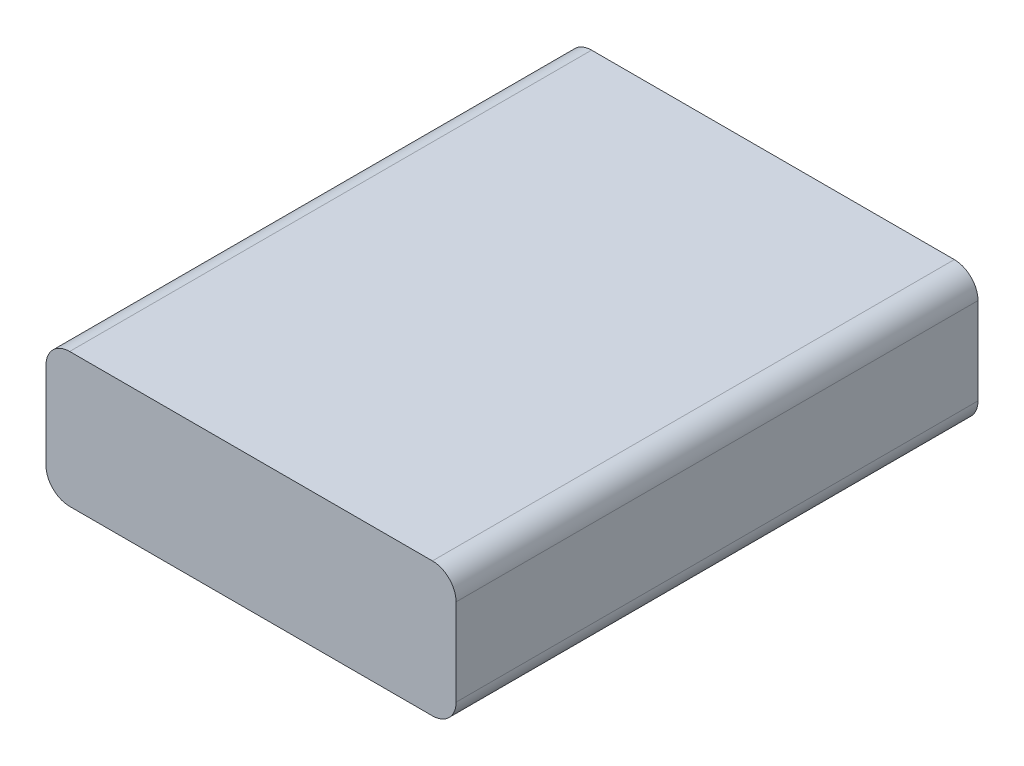
ISO-10303-21;
HEADER;
FILE_DESCRIPTION(('STEP AP214'),'2;1');
FILE_NAME('part.step','',(''),(''),'','','');
FILE_SCHEMA(('AUTOMOTIVE_DESIGN { 1 0 10303 214 1 1 1 1 }'));
ENDSEC;
DATA;
#1=APPLICATION_CONTEXT('core data for automotive mechanical design processes');
#2=APPLICATION_PROTOCOL_DEFINITION('international standard','automotive_design',2000,#1);
#3=PRODUCT_CONTEXT('',#1,'mechanical');
#4=PRODUCT('Part','Part','',(#3));
#5=PRODUCT_RELATED_PRODUCT_CATEGORY('part','',(#4));
#6=PRODUCT_DEFINITION_FORMATION('','',#4);
#7=PRODUCT_DEFINITION_CONTEXT('part definition',#1,'design');
#8=PRODUCT_DEFINITION('design','',#6,#7);
#9=PRODUCT_DEFINITION_SHAPE('','',#8);
#10=(LENGTH_UNIT() NAMED_UNIT(*) SI_UNIT(.MILLI.,.METRE.));
#11=(NAMED_UNIT(*) PLANE_ANGLE_UNIT() SI_UNIT($,.RADIAN.));
#12=(NAMED_UNIT(*) SI_UNIT($,.STERADIAN.) SOLID_ANGLE_UNIT());
#13=UNCERTAINTY_MEASURE_WITH_UNIT(LENGTH_MEASURE(1.E-05),#10,'distance_accuracy_value','');
#14=(GEOMETRIC_REPRESENTATION_CONTEXT(3) GLOBAL_UNCERTAINTY_ASSIGNED_CONTEXT((#13)) GLOBAL_UNIT_ASSIGNED_CONTEXT((#10,
#11,#12)) REPRESENTATION_CONTEXT('',''));
#15=CARTESIAN_POINT('',(0.,0.,0.));
#16=DIRECTION('',(0.,0.,1.));
#17=DIRECTION('',(1.,0.,0.));
#18=AXIS2_PLACEMENT_3D('',#15,#16,#17);
#19=CARTESIAN_POINT('',(24.325,14.825,70.));
#20=DIRECTION('',(0.,0.,-1.));
#21=DIRECTION('',(-1.,0.,0.));
#22=AXIS2_PLACEMENT_3D('',#19,#20,#21);
#23=CYLINDRICAL_SURFACE('',#22,3.175);
#24=CARTESIAN_POINT('',(24.325,14.825,0.));
#25=DIRECTION('',(0.,0.,1.));
#26=DIRECTION('',(-1.,0.,0.));
#27=AXIS2_PLACEMENT_3D('',#24,#25,#26);
#28=CIRCLE('',#27,3.175);
#29=CARTESIAN_POINT('',(27.5,14.825,0.));
#30=VERTEX_POINT('',#29);
#31=CARTESIAN_POINT('',(24.325,18.,0.));
#32=VERTEX_POINT('',#31);
#33=EDGE_CURVE('E139',#30,#32,#28,.T.);
#34=ORIENTED_EDGE('',*,*,#33,.T.);
#35=DIRECTION('',(0.,0.,-1.));
#36=VECTOR('',#35,1.);
#37=CARTESIAN_POINT('',(24.325,18.,70.));
#38=LINE('',#37,#36);
#39=CARTESIAN_POINT('',(24.325,18.,70.));
#40=VERTEX_POINT('',#39);
#41=EDGE_CURVE('E11',#40,#32,#38,.T.);
#42=ORIENTED_EDGE('',*,*,#41,.F.);
#43=CARTESIAN_POINT('',(24.325,14.825,70.));
#44=DIRECTION('',(0.,0.,1.));
#45=DIRECTION('',(-1.,0.,0.));
#46=AXIS2_PLACEMENT_3D('',#43,#44,#45);
#47=CIRCLE('',#46,3.175);
#48=CARTESIAN_POINT('',(27.5,14.825,70.));
#49=VERTEX_POINT('',#48);
#50=EDGE_CURVE('E153',#49,#40,#47,.T.);
#51=ORIENTED_EDGE('',*,*,#50,.F.);
#52=DIRECTION('',(0.,0.,-1.));
#53=VECTOR('',#52,1.);
#54=CARTESIAN_POINT('',(27.5,14.825,70.));
#55=LINE('',#54,#53);
#56=EDGE_CURVE('E135',#49,#30,#55,.T.);
#57=ORIENTED_EDGE('',*,*,#56,.T.);
#58=EDGE_LOOP('',(#34,#42,#51,#57));
#59=FACE_BOUND('',#58,.T.);
#60=ADVANCED_FACE('F40',(#59),#23,.T.);
#61=CARTESIAN_POINT('',(-24.325,18.,70.));
#62=DIRECTION('',(0.,-1.,0.));
#63=DIRECTION('',(1.,0.,0.));
#64=AXIS2_PLACEMENT_3D('',#61,#62,#63);
#65=PLANE('',#64);
#66=DIRECTION('',(-1.,0.,0.));
#67=VECTOR('',#66,1.);
#68=CARTESIAN_POINT('',(-24.325,18.,0.));
#69=LINE('',#68,#67);
#70=CARTESIAN_POINT('',(-24.325,18.,0.));
#71=VERTEX_POINT('',#70);
#72=EDGE_CURVE('E142',#32,#71,#69,.T.);
#73=ORIENTED_EDGE('',*,*,#72,.T.);
#74=DIRECTION('',(0.,0.,-1.));
#75=VECTOR('',#74,1.);
#76=CARTESIAN_POINT('',(-24.325,18.,70.));
#77=LINE('',#76,#75);
#78=CARTESIAN_POINT('',(-24.325,18.,70.));
#79=VERTEX_POINT('',#78);
#80=EDGE_CURVE('E49',#79,#71,#77,.T.);
#81=ORIENTED_EDGE('',*,*,#80,.F.);
#82=DIRECTION('',(-1.,0.,0.));
#83=VECTOR('',#82,1.);
#84=CARTESIAN_POINT('',(-24.325,18.,70.));
#85=LINE('',#84,#83);
#86=EDGE_CURVE('E100',#40,#79,#85,.T.);
#87=ORIENTED_EDGE('',*,*,#86,.F.);
#88=ORIENTED_EDGE('',*,*,#41,.T.);
#89=EDGE_LOOP('',(#73,#81,#87,#88));
#90=FACE_BOUND('',#89,.T.);
#91=ADVANCED_FACE('F194',(#90),#65,.F.);
#92=CARTESIAN_POINT('',(-24.325,14.825,70.));
#93=DIRECTION('',(0.,0.,-1.));
#94=DIRECTION('',(-1.,0.,0.));
#95=AXIS2_PLACEMENT_3D('',#92,#93,#94);
#96=CYLINDRICAL_SURFACE('',#95,3.175);
#97=CARTESIAN_POINT('',(-24.325,14.825,0.));
#98=DIRECTION('',(0.,0.,1.));
#99=DIRECTION('',(-1.,0.,0.));
#100=AXIS2_PLACEMENT_3D('',#97,#98,#99);
#101=CIRCLE('',#100,3.175);
#102=CARTESIAN_POINT('',(-27.5,14.825,0.));
#103=VERTEX_POINT('',#102);
#104=EDGE_CURVE('E144',#71,#103,#101,.T.);
#105=ORIENTED_EDGE('',*,*,#104,.T.);
#106=DIRECTION('',(0.,0.,-1.));
#107=VECTOR('',#106,1.);
#108=CARTESIAN_POINT('',(-27.5,14.825,70.));
#109=LINE('',#108,#107);
#110=CARTESIAN_POINT('',(-27.5,14.825,70.));
#111=VERTEX_POINT('',#110);
#112=EDGE_CURVE('E164',#111,#103,#109,.T.);
#113=ORIENTED_EDGE('',*,*,#112,.F.);
#114=CARTESIAN_POINT('',(-24.325,14.825,70.));
#115=DIRECTION('',(0.,0.,1.));
#116=DIRECTION('',(-1.,0.,0.));
#117=AXIS2_PLACEMENT_3D('',#114,#115,#116);
#118=CIRCLE('',#117,3.175);
#119=EDGE_CURVE('E174',#79,#111,#118,.T.);
#120=ORIENTED_EDGE('',*,*,#119,.F.);
#121=ORIENTED_EDGE('',*,*,#80,.T.);
#122=EDGE_LOOP('',(#105,#113,#120,#121));
#123=FACE_BOUND('',#122,.T.);
#124=ADVANCED_FACE('F172',(#123),#96,.T.);
#125=CARTESIAN_POINT('',(-27.5,3.175,70.));
#126=DIRECTION('',(1.,0.,0.));
#127=DIRECTION('',(0.,1.,0.));
#128=AXIS2_PLACEMENT_3D('',#125,#126,#127);
#129=PLANE('',#128);
#130=DIRECTION('',(0.,-1.,0.));
#131=VECTOR('',#130,1.);
#132=CARTESIAN_POINT('',(-27.5,3.175,0.));
#133=LINE('',#132,#131);
#134=CARTESIAN_POINT('',(-27.5,3.175,0.));
#135=VERTEX_POINT('',#134);
#136=EDGE_CURVE('E146',#103,#135,#133,.T.);
#137=ORIENTED_EDGE('',*,*,#136,.T.);
#138=DIRECTION('',(0.,0.,-1.));
#139=VECTOR('',#138,1.);
#140=CARTESIAN_POINT('',(-27.5,3.175,70.));
#141=LINE('',#140,#139);
#142=CARTESIAN_POINT('',(-27.5,3.175,70.));
#143=VERTEX_POINT('',#142);
#144=EDGE_CURVE('E160',#143,#135,#141,.T.);
#145=ORIENTED_EDGE('',*,*,#144,.F.);
#146=DIRECTION('',(0.,-1.,0.));
#147=VECTOR('',#146,1.);
#148=CARTESIAN_POINT('',(-27.5,3.175,70.));
#149=LINE('',#148,#147);
#150=EDGE_CURVE('E186',#111,#143,#149,.T.);
#151=ORIENTED_EDGE('',*,*,#150,.F.);
#152=ORIENTED_EDGE('',*,*,#112,.T.);
#153=EDGE_LOOP('',(#137,#145,#151,#152));
#154=FACE_BOUND('',#153,.T.);
#155=ADVANCED_FACE('F182',(#154),#129,.F.);
#156=CARTESIAN_POINT('',(-24.325,3.175,70.));
#157=DIRECTION('',(0.,0.,-1.));
#158=DIRECTION('',(-1.,0.,0.));
#159=AXIS2_PLACEMENT_3D('',#156,#157,#158);
#160=CYLINDRICAL_SURFACE('',#159,3.175);
#161=CARTESIAN_POINT('',(-24.325,3.175,0.));
#162=DIRECTION('',(0.,0.,1.));
#163=DIRECTION('',(-1.,0.,0.));
#164=AXIS2_PLACEMENT_3D('',#161,#162,#163);
#165=CIRCLE('',#164,3.175);
#166=CARTESIAN_POINT('',(-24.325,0.,0.));
#167=VERTEX_POINT('',#166);
#168=EDGE_CURVE('E148',#135,#167,#165,.T.);
#169=ORIENTED_EDGE('',*,*,#168,.T.);
#170=DIRECTION('',(0.,0.,-1.));
#171=VECTOR('',#170,1.);
#172=CARTESIAN_POINT('',(-24.325,0.,70.));
#173=LINE('',#172,#171);
#174=CARTESIAN_POINT('',(-24.325,0.,70.));
#175=VERTEX_POINT('',#174);
#176=EDGE_CURVE('E130',#175,#167,#173,.T.);
#177=ORIENTED_EDGE('',*,*,#176,.F.);
#178=CARTESIAN_POINT('',(-24.325,3.175,70.));
#179=DIRECTION('',(0.,0.,1.));
#180=DIRECTION('',(-1.,0.,0.));
#181=AXIS2_PLACEMENT_3D('',#178,#179,#180);
#182=CIRCLE('',#181,3.175);
#183=EDGE_CURVE('E119',#143,#175,#182,.T.);
#184=ORIENTED_EDGE('',*,*,#183,.F.);
#185=ORIENTED_EDGE('',*,*,#144,.T.);
#186=EDGE_LOOP('',(#169,#177,#184,#185));
#187=FACE_BOUND('',#186,.T.);
#188=ADVANCED_FACE('F185',(#187),#160,.T.);
#189=CARTESIAN_POINT('',(-24.325,0.,70.));
#190=DIRECTION('',(0.,1.,0.));
#191=DIRECTION('',(-1.,0.,0.));
#192=AXIS2_PLACEMENT_3D('',#189,#190,#191);
#193=PLANE('',#192);
#194=DIRECTION('',(1.,0.,0.));
#195=VECTOR('',#194,1.);
#196=CARTESIAN_POINT('',(-24.325,0.,0.));
#197=LINE('',#196,#195);
#198=CARTESIAN_POINT('',(24.325,0.,0.));
#199=VERTEX_POINT('',#198);
#200=EDGE_CURVE('E128',#167,#199,#197,.T.);
#201=ORIENTED_EDGE('',*,*,#200,.T.);
#202=DIRECTION('',(0.,0.,-1.));
#203=VECTOR('',#202,1.);
#204=CARTESIAN_POINT('',(24.325,0.,70.));
#205=LINE('',#204,#203);
#206=CARTESIAN_POINT('',(24.325,0.,70.));
#207=VERTEX_POINT('',#206);
#208=EDGE_CURVE('E125',#207,#199,#205,.T.);
#209=ORIENTED_EDGE('',*,*,#208,.F.);
#210=DIRECTION('',(1.,0.,0.));
#211=VECTOR('',#210,1.);
#212=CARTESIAN_POINT('',(-24.325,0.,70.));
#213=LINE('',#212,#211);
#214=EDGE_CURVE('E113',#175,#207,#213,.T.);
#215=ORIENTED_EDGE('',*,*,#214,.F.);
#216=ORIENTED_EDGE('',*,*,#176,.T.);
#217=EDGE_LOOP('',(#201,#209,#215,#216));
#218=FACE_BOUND('',#217,.T.);
#219=ADVANCED_FACE('F126',(#218),#193,.F.);
#220=CARTESIAN_POINT('',(24.325,3.17500000000001,70.));
#221=DIRECTION('',(0.,0.,-1.));
#222=DIRECTION('',(-1.,0.,0.));
#223=AXIS2_PLACEMENT_3D('',#220,#221,#222);
#224=CYLINDRICAL_SURFACE('',#223,3.175);
#225=CARTESIAN_POINT('',(24.325,3.17500000000001,0.));
#226=DIRECTION('',(0.,0.,1.));
#227=DIRECTION('',(1.,0.,0.));
#228=AXIS2_PLACEMENT_3D('',#225,#226,#227);
#229=CIRCLE('',#228,3.175);
#230=CARTESIAN_POINT('',(27.5,3.17500000000001,0.));
#231=VERTEX_POINT('',#230);
#232=EDGE_CURVE('E86',#199,#231,#229,.T.);
#233=ORIENTED_EDGE('',*,*,#232,.T.);
#234=DIRECTION('',(0.,0.,-1.));
#235=VECTOR('',#234,1.);
#236=CARTESIAN_POINT('',(27.5,3.17500000000001,70.));
#237=LINE('',#236,#235);
#238=CARTESIAN_POINT('',(27.5,3.17500000000001,70.));
#239=VERTEX_POINT('',#238);
#240=EDGE_CURVE('E131',#239,#231,#237,.T.);
#241=ORIENTED_EDGE('',*,*,#240,.F.);
#242=CARTESIAN_POINT('',(24.325,3.17500000000001,70.));
#243=DIRECTION('',(0.,0.,1.));
#244=DIRECTION('',(1.,0.,0.));
#245=AXIS2_PLACEMENT_3D('',#242,#243,#244);
#246=CIRCLE('',#245,3.175);
#247=EDGE_CURVE('E117',#207,#239,#246,.T.);
#248=ORIENTED_EDGE('',*,*,#247,.F.);
#249=ORIENTED_EDGE('',*,*,#208,.T.);
#250=EDGE_LOOP('',(#233,#241,#248,#249));
#251=FACE_BOUND('',#250,.T.);
#252=ADVANCED_FACE('F133',(#251),#224,.T.);
#253=CARTESIAN_POINT('',(27.5,3.17500000000001,70.));
#254=DIRECTION('',(-1.,0.,0.));
#255=DIRECTION('',(0.,-1.,0.));
#256=AXIS2_PLACEMENT_3D('',#253,#254,#255);
#257=PLANE('',#256);
#258=DIRECTION('',(0.,1.,0.));
#259=VECTOR('',#258,1.);
#260=CARTESIAN_POINT('',(27.5,3.17500000000001,0.));
#261=LINE('',#260,#259);
#262=EDGE_CURVE('E92',#231,#30,#261,.T.);
#263=ORIENTED_EDGE('',*,*,#262,.T.);
#264=ORIENTED_EDGE('',*,*,#56,.F.);
#265=DIRECTION('',(0.,1.,0.));
#266=VECTOR('',#265,1.);
#267=CARTESIAN_POINT('',(27.5,3.17500000000001,70.));
#268=LINE('',#267,#266);
#269=EDGE_CURVE('E57',#239,#49,#268,.T.);
#270=ORIENTED_EDGE('',*,*,#269,.F.);
#271=ORIENTED_EDGE('',*,*,#240,.T.);
#272=EDGE_LOOP('',(#263,#264,#270,#271));
#273=FACE_BOUND('',#272,.T.);
#274=ADVANCED_FACE('F210',(#273),#257,.F.);
#275=CARTESIAN_POINT('',(24.325,14.825,70.));
#276=DIRECTION('',(0.,0.,-1.));
#277=DIRECTION('',(-1.,0.,0.));
#278=AXIS2_PLACEMENT_3D('',#275,#276,#277);
#279=PLANE('',#278);
#280=ORIENTED_EDGE('',*,*,#50,.T.);
#281=ORIENTED_EDGE('',*,*,#86,.T.);
#282=ORIENTED_EDGE('',*,*,#119,.T.);
#283=ORIENTED_EDGE('',*,*,#150,.T.);
#284=ORIENTED_EDGE('',*,*,#183,.T.);
#285=ORIENTED_EDGE('',*,*,#214,.T.);
#286=ORIENTED_EDGE('',*,*,#247,.T.);
#287=ORIENTED_EDGE('',*,*,#269,.T.);
#288=EDGE_LOOP('',(#280,#281,#282,#283,#284,#285,#286,#287));
#289=FACE_BOUND('',#288,.T.);
#290=ADVANCED_FACE('F115',(#289),#279,.F.);
#291=CARTESIAN_POINT('',(24.325,14.825,0.));
#292=DIRECTION('',(0.,0.,-1.));
#293=DIRECTION('',(-1.,0.,0.));
#294=AXIS2_PLACEMENT_3D('',#291,#292,#293);
#295=PLANE('',#294);
#296=ORIENTED_EDGE('',*,*,#33,.F.);
#297=ORIENTED_EDGE('',*,*,#262,.F.);
#298=ORIENTED_EDGE('',*,*,#232,.F.);
#299=ORIENTED_EDGE('',*,*,#200,.F.);
#300=ORIENTED_EDGE('',*,*,#168,.F.);
#301=ORIENTED_EDGE('',*,*,#136,.F.);
#302=ORIENTED_EDGE('',*,*,#104,.F.);
#303=ORIENTED_EDGE('',*,*,#72,.F.);
#304=EDGE_LOOP('',(#296,#297,#298,#299,#300,#301,#302,#303));
#305=FACE_BOUND('',#304,.T.);
#306=ADVANCED_FACE('F178',(#305),#295,.T.);
#307=CLOSED_SHELL('',(#60,#91,#124,#155,#188,#219,#252,#274,#290,#306));
#308=MANIFOLD_SOLID_BREP('B2',#307);
#309=ADVANCED_BREP_SHAPE_REPRESENTATION('',(#18,#308),#14);
#310=SHAPE_DEFINITION_REPRESENTATION(#9,#309);
ENDSEC;
END-ISO-10303-21;
